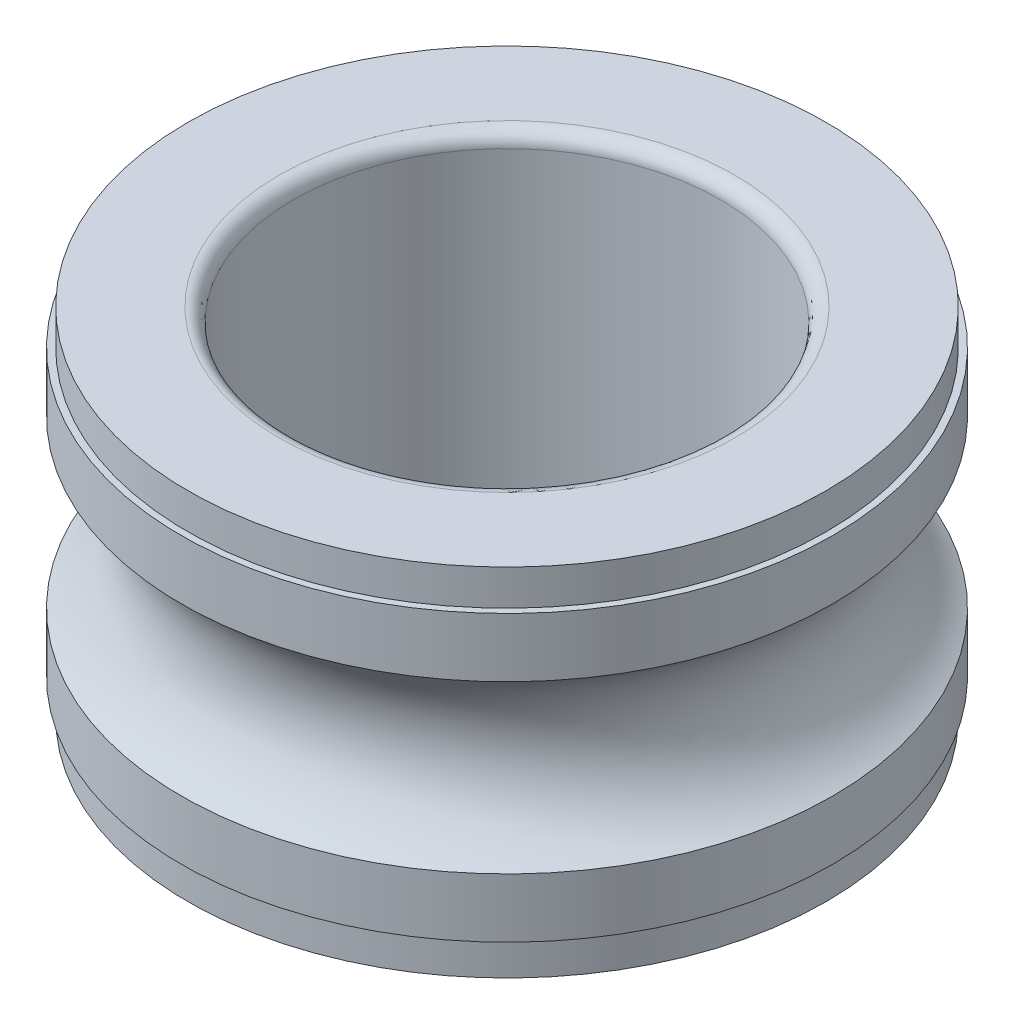
ISO-10303-21;
HEADER;
FILE_DESCRIPTION(('STEP AP214'),'2;1');
FILE_NAME('part.step','',(''),(''),'','','');
FILE_SCHEMA(('AUTOMOTIVE_DESIGN { 1 0 10303 214 1 1 1 1 }'));
ENDSEC;
DATA;
#1=APPLICATION_CONTEXT('core data for automotive mechanical design processes');
#2=APPLICATION_PROTOCOL_DEFINITION('international standard','automotive_design',2000,#1);
#3=PRODUCT_CONTEXT('',#1,'mechanical');
#4=PRODUCT('Part','Part','',(#3));
#5=PRODUCT_RELATED_PRODUCT_CATEGORY('part','',(#4));
#6=PRODUCT_DEFINITION_FORMATION('','',#4);
#7=PRODUCT_DEFINITION_CONTEXT('part definition',#1,'design');
#8=PRODUCT_DEFINITION('design','',#6,#7);
#9=PRODUCT_DEFINITION_SHAPE('','',#8);
#10=(LENGTH_UNIT() NAMED_UNIT(*) SI_UNIT(.MILLI.,.METRE.));
#11=(NAMED_UNIT(*) PLANE_ANGLE_UNIT() SI_UNIT($,.RADIAN.));
#12=(NAMED_UNIT(*) SI_UNIT($,.STERADIAN.) SOLID_ANGLE_UNIT());
#13=UNCERTAINTY_MEASURE_WITH_UNIT(LENGTH_MEASURE(1.E-05),#10,'distance_accuracy_value','');
#14=(GEOMETRIC_REPRESENTATION_CONTEXT(3) GLOBAL_UNCERTAINTY_ASSIGNED_CONTEXT((#13)) GLOBAL_UNIT_ASSIGNED_CONTEXT((#10,
#11,#12)) REPRESENTATION_CONTEXT('',''));
#15=CARTESIAN_POINT('',(0.,0.,0.));
#16=DIRECTION('',(0.,0.,1.));
#17=DIRECTION('',(1.,0.,0.));
#18=AXIS2_PLACEMENT_3D('',#15,#16,#17);
#19=CARTESIAN_POINT('',(4.4835,-0.500000000000001,0.));
#20=DIRECTION('',(0.,1.,0.));
#21=DIRECTION('',(-1.,0.,0.));
#22=AXIS2_PLACEMENT_3D('',#19,#20,#21);
#23=PLANE('',#22);
#24=CARTESIAN_POINT('',(0.,-0.5,0.));
#25=DIRECTION('',(0.,1.,0.));
#26=DIRECTION('',(-1.,0.,0.));
#27=AXIS2_PLACEMENT_3D('',#24,#25,#26);
#28=CIRCLE('',#27,4.575);
#29=CARTESIAN_POINT('',(-4.575,-0.499999999999999,0.));
#30=VERTEX_POINT('',#29);
#31=EDGE_CURVE('E70',#30,#30,#28,.T.);
#32=ORIENTED_EDGE('',*,*,#31,.T.);
#33=EDGE_LOOP('',(#32));
#34=FACE_BOUND('',#33,.T.);
#35=CARTESIAN_POINT('',(0.,-0.5,0.));
#36=DIRECTION('',(0.,1.,0.));
#37=DIRECTION('',(-1.,0.,0.));
#38=AXIS2_PLACEMENT_3D('',#35,#36,#37);
#39=CIRCLE('',#38,4.4835);
#40=CARTESIAN_POINT('',(-4.4835,-0.499999999999999,0.));
#41=VERTEX_POINT('',#40);
#42=EDGE_CURVE('E10',#41,#41,#39,.T.);
#43=ORIENTED_EDGE('',*,*,#42,.F.);
#44=EDGE_LOOP('',(#43));
#45=FACE_BOUND('',#44,.T.);
#46=ADVANCED_FACE('F30',(#34,#45),#23,.T.);
#47=CARTESIAN_POINT('',(0.,-5.00349574367179,0.));
#48=DIRECTION('',(0.,1.,0.));
#49=DIRECTION('',(-1.,0.,0.));
#50=AXIS2_PLACEMENT_3D('',#47,#48,#49);
#51=CYLINDRICAL_SURFACE('',#50,4.4835);
#52=ORIENTED_EDGE('',*,*,#42,.T.);
#53=EDGE_LOOP('',(#52));
#54=FACE_BOUND('',#53,.T.);
#55=CARTESIAN_POINT('',(0.,0.,0.));
#56=DIRECTION('',(0.,1.,0.));
#57=DIRECTION('',(-1.,0.,0.));
#58=AXIS2_PLACEMENT_3D('',#55,#56,#57);
#59=CIRCLE('',#58,4.4835);
#60=CARTESIAN_POINT('',(-4.4835,0.,0.));
#61=VERTEX_POINT('',#60);
#62=EDGE_CURVE('E36',#61,#61,#59,.T.);
#63=ORIENTED_EDGE('',*,*,#62,.F.);
#64=EDGE_LOOP('',(#63));
#65=FACE_BOUND('',#64,.T.);
#66=ADVANCED_FACE('F88',(#54,#65),#51,.T.);
#67=CARTESIAN_POINT('',(3.2,0.,0.));
#68=DIRECTION('',(0.,1.,0.));
#69=DIRECTION('',(-1.,0.,0.));
#70=AXIS2_PLACEMENT_3D('',#67,#68,#69);
#71=PLANE('',#70);
#72=ORIENTED_EDGE('',*,*,#62,.T.);
#73=EDGE_LOOP('',(#72));
#74=FACE_BOUND('',#73,.T.);
#75=CARTESIAN_POINT('',(0.,0.,0.));
#76=DIRECTION('',(0.,1.,0.));
#77=DIRECTION('',(-1.,0.,0.));
#78=AXIS2_PLACEMENT_3D('',#75,#76,#77);
#79=CIRCLE('',#78,3.2);
#80=CARTESIAN_POINT('',(-3.2,0.,0.));
#81=VERTEX_POINT('',#80);
#82=EDGE_CURVE('E40',#81,#81,#79,.T.);
#83=ORIENTED_EDGE('',*,*,#82,.F.);
#84=EDGE_LOOP('',(#83));
#85=FACE_BOUND('',#84,.T.);
#86=ADVANCED_FACE('F92',(#74,#85),#71,.T.);
#87=CARTESIAN_POINT('',(0.,-0.2,0.));
#88=DIRECTION('',(0.,1.,0.));
#89=DIRECTION('',(-1.,0.,0.));
#90=AXIS2_PLACEMENT_3D('',#87,#88,#89);
#91=TOROIDAL_SURFACE('',#90,3.2,0.2);
#92=ORIENTED_EDGE('',*,*,#82,.T.);
#93=EDGE_LOOP('',(#92));
#94=FACE_BOUND('',#93,.T.);
#95=CARTESIAN_POINT('',(0.,-0.199999999999999,0.));
#96=DIRECTION('',(0.,1.,0.));
#97=DIRECTION('',(-1.,0.,0.));
#98=AXIS2_PLACEMENT_3D('',#95,#96,#97);
#99=CIRCLE('',#98,3.);
#100=CARTESIAN_POINT('',(-3.,-0.199999999999998,0.));
#101=VERTEX_POINT('',#100);
#102=EDGE_CURVE('E44',#101,#101,#99,.T.);
#103=ORIENTED_EDGE('',*,*,#102,.F.);
#104=EDGE_LOOP('',(#103));
#105=FACE_BOUND('',#104,.T.);
#106=ADVANCED_FACE('F96',(#94,#105),#91,.T.);
#107=CARTESIAN_POINT('',(0.,-5.00349574367179,0.));
#108=DIRECTION('',(0.,1.,0.));
#109=DIRECTION('',(-1.,0.,0.));
#110=AXIS2_PLACEMENT_3D('',#107,#108,#109);
#111=CYLINDRICAL_SURFACE('',#110,3.);
#112=ORIENTED_EDGE('',*,*,#102,.T.);
#113=EDGE_LOOP('',(#112));
#114=FACE_BOUND('',#113,.T.);
#115=CARTESIAN_POINT('',(0.,-4.8,0.));
#116=DIRECTION('',(0.,1.,0.));
#117=DIRECTION('',(-1.,0.,0.));
#118=AXIS2_PLACEMENT_3D('',#115,#116,#117);
#119=CIRCLE('',#118,3.);
#120=CARTESIAN_POINT('',(-3.,-4.8,0.));
#121=VERTEX_POINT('',#120);
#122=EDGE_CURVE('E49',#121,#121,#119,.T.);
#123=ORIENTED_EDGE('',*,*,#122,.F.);
#124=EDGE_LOOP('',(#123));
#125=FACE_BOUND('',#124,.T.);
#126=ADVANCED_FACE('F102',(#114,#125),#111,.F.);
#127=CARTESIAN_POINT('',(0.,-4.8,0.));
#128=DIRECTION('',(0.,1.,0.));
#129=DIRECTION('',(-1.,0.,0.));
#130=AXIS2_PLACEMENT_3D('',#127,#128,#129);
#131=TOROIDAL_SURFACE('',#130,3.2,0.200000000000001);
#132=ORIENTED_EDGE('',*,*,#122,.T.);
#133=EDGE_LOOP('',(#132));
#134=FACE_BOUND('',#133,.T.);
#135=CARTESIAN_POINT('',(0.,-5.,0.));
#136=DIRECTION('',(0.,1.,0.));
#137=DIRECTION('',(-1.,0.,0.));
#138=AXIS2_PLACEMENT_3D('',#135,#136,#137);
#139=CIRCLE('',#138,3.2);
#140=CARTESIAN_POINT('',(-3.2,-5.,0.));
#141=VERTEX_POINT('',#140);
#142=EDGE_CURVE('E52',#141,#141,#139,.T.);
#143=ORIENTED_EDGE('',*,*,#142,.F.);
#144=EDGE_LOOP('',(#143));
#145=FACE_BOUND('',#144,.T.);
#146=ADVANCED_FACE('F106',(#134,#145),#131,.T.);
#147=CARTESIAN_POINT('',(4.4835,-5.,0.));
#148=DIRECTION('',(0.,-1.,0.));
#149=DIRECTION('',(1.,0.,0.));
#150=AXIS2_PLACEMENT_3D('',#147,#148,#149);
#151=PLANE('',#150);
#152=ORIENTED_EDGE('',*,*,#142,.T.);
#153=EDGE_LOOP('',(#152));
#154=FACE_BOUND('',#153,.T.);
#155=CARTESIAN_POINT('',(0.,-5.,0.));
#156=DIRECTION('',(0.,1.,0.));
#157=DIRECTION('',(-1.,0.,0.));
#158=AXIS2_PLACEMENT_3D('',#155,#156,#157);
#159=CIRCLE('',#158,4.4835);
#160=CARTESIAN_POINT('',(-4.4835,-5.,0.));
#161=VERTEX_POINT('',#160);
#162=EDGE_CURVE('E55',#161,#161,#159,.T.);
#163=ORIENTED_EDGE('',*,*,#162,.F.);
#164=EDGE_LOOP('',(#163));
#165=FACE_BOUND('',#164,.T.);
#166=ADVANCED_FACE('F110',(#154,#165),#151,.T.);
#167=CARTESIAN_POINT('',(0.,-5.00349574367179,0.));
#168=DIRECTION('',(0.,1.,0.));
#169=DIRECTION('',(-1.,0.,0.));
#170=AXIS2_PLACEMENT_3D('',#167,#168,#169);
#171=CYLINDRICAL_SURFACE('',#170,4.4835);
#172=ORIENTED_EDGE('',*,*,#162,.T.);
#173=EDGE_LOOP('',(#172));
#174=FACE_BOUND('',#173,.T.);
#175=CARTESIAN_POINT('',(0.,-4.5,0.));
#176=DIRECTION('',(0.,1.,0.));
#177=DIRECTION('',(-1.,0.,0.));
#178=AXIS2_PLACEMENT_3D('',#175,#176,#177);
#179=CIRCLE('',#178,4.4835);
#180=CARTESIAN_POINT('',(-4.4835,-4.5,0.));
#181=VERTEX_POINT('',#180);
#182=EDGE_CURVE('E58',#181,#181,#179,.T.);
#183=ORIENTED_EDGE('',*,*,#182,.F.);
#184=EDGE_LOOP('',(#183));
#185=FACE_BOUND('',#184,.T.);
#186=ADVANCED_FACE('F114',(#174,#185),#171,.T.);
#187=CARTESIAN_POINT('',(4.575,-4.5,0.));
#188=DIRECTION('',(0.,-1.,0.));
#189=DIRECTION('',(1.,0.,0.));
#190=AXIS2_PLACEMENT_3D('',#187,#188,#189);
#191=PLANE('',#190);
#192=ORIENTED_EDGE('',*,*,#182,.T.);
#193=EDGE_LOOP('',(#192));
#194=FACE_BOUND('',#193,.T.);
#195=CARTESIAN_POINT('',(0.,-4.5,0.));
#196=DIRECTION('',(0.,1.,0.));
#197=DIRECTION('',(-1.,0.,0.));
#198=AXIS2_PLACEMENT_3D('',#195,#196,#197);
#199=CIRCLE('',#198,4.575);
#200=CARTESIAN_POINT('',(-4.575,-4.5,0.));
#201=VERTEX_POINT('',#200);
#202=EDGE_CURVE('E61',#201,#201,#199,.T.);
#203=ORIENTED_EDGE('',*,*,#202,.F.);
#204=EDGE_LOOP('',(#203));
#205=FACE_BOUND('',#204,.T.);
#206=ADVANCED_FACE('F118',(#194,#205),#191,.T.);
#207=CARTESIAN_POINT('',(0.,-5.00349574367179,0.));
#208=DIRECTION('',(0.,1.,0.));
#209=DIRECTION('',(-1.,0.,0.));
#210=AXIS2_PLACEMENT_3D('',#207,#208,#209);
#211=CYLINDRICAL_SURFACE('',#210,4.575);
#212=ORIENTED_EDGE('',*,*,#202,.T.);
#213=EDGE_LOOP('',(#212));
#214=FACE_BOUND('',#213,.T.);
#215=CARTESIAN_POINT('',(0.,-3.66913429510899,0.));
#216=DIRECTION('',(0.,1.,0.));
#217=DIRECTION('',(-1.,0.,0.));
#218=AXIS2_PLACEMENT_3D('',#215,#216,#217);
#219=CIRCLE('',#218,4.575);
#220=CARTESIAN_POINT('',(-4.575,-3.66913429510899,0.));
#221=VERTEX_POINT('',#220);
#222=EDGE_CURVE('E64',#221,#221,#219,.T.);
#223=ORIENTED_EDGE('',*,*,#222,.F.);
#224=EDGE_LOOP('',(#223));
#225=FACE_BOUND('',#224,.T.);
#226=ADVANCED_FACE('F84',(#214,#225),#211,.T.);
#227=CARTESIAN_POINT('',(0.,-2.5,0.));
#228=DIRECTION('',(0.,1.,0.));
#229=DIRECTION('',(-1.,0.,0.));
#230=AXIS2_PLACEMENT_3D('',#227,#228,#229);
#231=TOROIDAL_SURFACE('',#230,5.25,1.35);
#232=ORIENTED_EDGE('',*,*,#222,.T.);
#233=EDGE_LOOP('',(#232));
#234=FACE_BOUND('',#233,.T.);
#235=CARTESIAN_POINT('',(0.,-1.33086570489101,0.));
#236=DIRECTION('',(0.,1.,0.));
#237=DIRECTION('',(-1.,0.,0.));
#238=AXIS2_PLACEMENT_3D('',#235,#236,#237);
#239=CIRCLE('',#238,4.575);
#240=CARTESIAN_POINT('',(-4.575,-1.33086570489101,0.));
#241=VERTEX_POINT('',#240);
#242=EDGE_CURVE('E67',#241,#241,#239,.T.);
#243=ORIENTED_EDGE('',*,*,#242,.F.);
#244=EDGE_LOOP('',(#243));
#245=FACE_BOUND('',#244,.T.);
#246=ADVANCED_FACE('F78',(#234,#245),#231,.F.);
#247=CARTESIAN_POINT('',(0.,-5.00349574367179,0.));
#248=DIRECTION('',(0.,1.,0.));
#249=DIRECTION('',(-1.,0.,0.));
#250=AXIS2_PLACEMENT_3D('',#247,#248,#249);
#251=CYLINDRICAL_SURFACE('',#250,4.575);
#252=ORIENTED_EDGE('',*,*,#242,.T.);
#253=EDGE_LOOP('',(#252));
#254=FACE_BOUND('',#253,.T.);
#255=ORIENTED_EDGE('',*,*,#31,.F.);
#256=EDGE_LOOP('',(#255));
#257=FACE_BOUND('',#256,.T.);
#258=ADVANCED_FACE('F76',(#254,#257),#251,.T.);
#259=CLOSED_SHELL('',(#46,#66,#86,#106,#126,#146,#166,#186,#206,#226,#246,#258));
#260=MANIFOLD_SOLID_BREP('B2',#259);
#261=ADVANCED_BREP_SHAPE_REPRESENTATION('',(#18,#260),#14);
#262=SHAPE_DEFINITION_REPRESENTATION(#9,#261);
ENDSEC;
END-ISO-10303-21;
